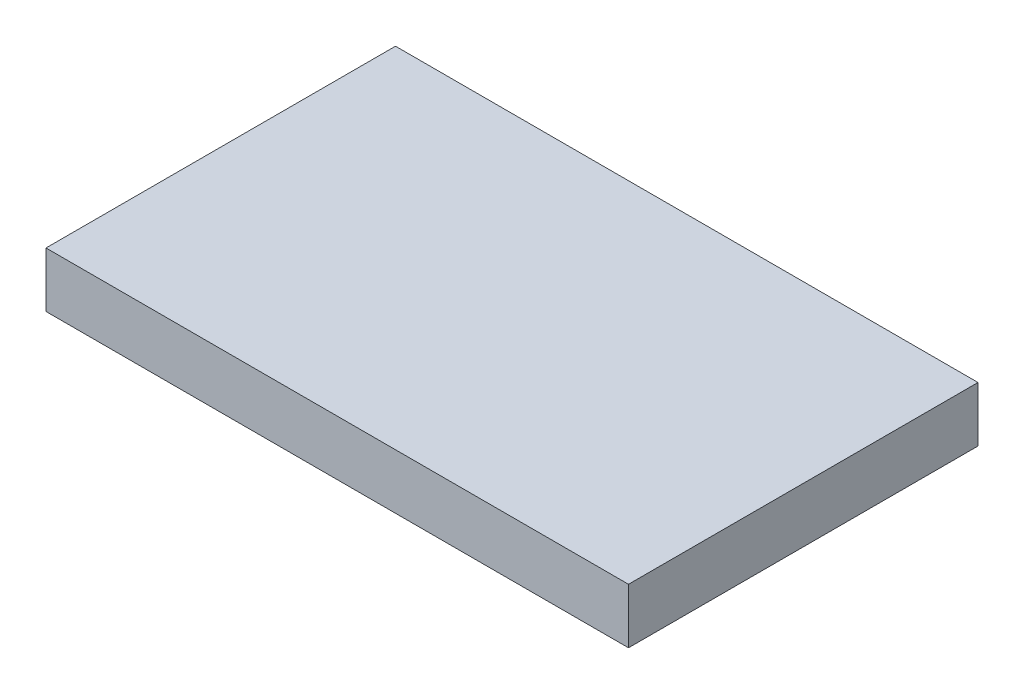
ISO-10303-21;
HEADER;
FILE_DESCRIPTION(('STEP AP214'),'2;1');
FILE_NAME('part.step','',(''),(''),'','','');
FILE_SCHEMA(('AUTOMOTIVE_DESIGN { 1 0 10303 214 1 1 1 1 }'));
ENDSEC;
DATA;
#1=APPLICATION_CONTEXT('core data for automotive mechanical design processes');
#2=APPLICATION_PROTOCOL_DEFINITION('international standard','automotive_design',2000,#1);
#3=PRODUCT_CONTEXT('',#1,'mechanical');
#4=PRODUCT('Part','Part','',(#3));
#5=PRODUCT_RELATED_PRODUCT_CATEGORY('part','',(#4));
#6=PRODUCT_DEFINITION_FORMATION('','',#4);
#7=PRODUCT_DEFINITION_CONTEXT('part definition',#1,'design');
#8=PRODUCT_DEFINITION('design','',#6,#7);
#9=PRODUCT_DEFINITION_SHAPE('','',#8);
#10=(LENGTH_UNIT() NAMED_UNIT(*) SI_UNIT(.MILLI.,.METRE.));
#11=(NAMED_UNIT(*) PLANE_ANGLE_UNIT() SI_UNIT($,.RADIAN.));
#12=(NAMED_UNIT(*) SI_UNIT($,.STERADIAN.) SOLID_ANGLE_UNIT());
#13=UNCERTAINTY_MEASURE_WITH_UNIT(LENGTH_MEASURE(1.E-05),#10,'distance_accuracy_value','');
#14=(GEOMETRIC_REPRESENTATION_CONTEXT(3) GLOBAL_UNCERTAINTY_ASSIGNED_CONTEXT((#13)) GLOBAL_UNIT_ASSIGNED_CONTEXT((#10,
#11,#12)) REPRESENTATION_CONTEXT('',''));
#15=CARTESIAN_POINT('',(0.,0.,0.));
#16=DIRECTION('',(0.,0.,1.));
#17=DIRECTION('',(1.,0.,0.));
#18=AXIS2_PLACEMENT_3D('',#15,#16,#17);
#19=CARTESIAN_POINT('',(15.875,3.,9.525));
#20=DIRECTION('',(-1.,0.,0.));
#21=DIRECTION('',(0.,0.,1.));
#22=AXIS2_PLACEMENT_3D('',#19,#20,#21);
#23=PLANE('',#22);
#24=DIRECTION('',(0.,0.,-1.));
#25=VECTOR('',#24,1.);
#26=CARTESIAN_POINT('',(15.875,0.,9.525));
#27=LINE('',#26,#25);
#28=CARTESIAN_POINT('',(15.875,0.,9.525));
#29=VERTEX_POINT('',#28);
#30=CARTESIAN_POINT('',(15.875,0.,-9.525));
#31=VERTEX_POINT('',#30);
#32=EDGE_CURVE('E98',#29,#31,#27,.T.);
#33=ORIENTED_EDGE('',*,*,#32,.T.);
#34=DIRECTION('',(0.,-1.,0.));
#35=VECTOR('',#34,1.);
#36=CARTESIAN_POINT('',(15.875,3.,-9.525));
#37=LINE('',#36,#35);
#38=CARTESIAN_POINT('',(15.875,3.,-9.525));
#39=VERTEX_POINT('',#38);
#40=EDGE_CURVE('E11',#39,#31,#37,.T.);
#41=ORIENTED_EDGE('',*,*,#40,.F.);
#42=DIRECTION('',(0.,0.,-1.));
#43=VECTOR('',#42,1.);
#44=CARTESIAN_POINT('',(15.875,3.,9.525));
#45=LINE('',#44,#43);
#46=CARTESIAN_POINT('',(15.875,3.,9.525));
#47=VERTEX_POINT('',#46);
#48=EDGE_CURVE('E86',#47,#39,#45,.T.);
#49=ORIENTED_EDGE('',*,*,#48,.F.);
#50=DIRECTION('',(0.,-1.,0.));
#51=VECTOR('',#50,1.);
#52=CARTESIAN_POINT('',(15.875,3.,9.525));
#53=LINE('',#52,#51);
#54=EDGE_CURVE('E94',#47,#29,#53,.T.);
#55=ORIENTED_EDGE('',*,*,#54,.T.);
#56=EDGE_LOOP('',(#33,#41,#49,#55));
#57=FACE_BOUND('',#56,.T.);
#58=ADVANCED_FACE('F35',(#57),#23,.F.);
#59=CARTESIAN_POINT('',(-15.875,3.,-9.525));
#60=DIRECTION('',(0.,0.,1.));
#61=DIRECTION('',(1.,0.,0.));
#62=AXIS2_PLACEMENT_3D('',#59,#60,#61);
#63=PLANE('',#62);
#64=DIRECTION('',(-1.,0.,0.));
#65=VECTOR('',#64,1.);
#66=CARTESIAN_POINT('',(-15.875,0.,-9.525));
#67=LINE('',#66,#65);
#68=CARTESIAN_POINT('',(-15.875,0.,-9.525));
#69=VERTEX_POINT('',#68);
#70=EDGE_CURVE('E90',#31,#69,#67,.T.);
#71=ORIENTED_EDGE('',*,*,#70,.T.);
#72=DIRECTION('',(0.,-1.,0.));
#73=VECTOR('',#72,1.);
#74=CARTESIAN_POINT('',(-15.875,3.,-9.525));
#75=LINE('',#74,#73);
#76=CARTESIAN_POINT('',(-15.875,3.,-9.525));
#77=VERTEX_POINT('',#76);
#78=EDGE_CURVE('E43',#77,#69,#75,.T.);
#79=ORIENTED_EDGE('',*,*,#78,.F.);
#80=DIRECTION('',(-1.,0.,0.));
#81=VECTOR('',#80,1.);
#82=CARTESIAN_POINT('',(-15.875,3.,-9.525));
#83=LINE('',#82,#81);
#84=EDGE_CURVE('E81',#39,#77,#83,.T.);
#85=ORIENTED_EDGE('',*,*,#84,.F.);
#86=ORIENTED_EDGE('',*,*,#40,.T.);
#87=EDGE_LOOP('',(#71,#79,#85,#86));
#88=FACE_BOUND('',#87,.T.);
#89=ADVANCED_FACE('F89',(#88),#63,.F.);
#90=CARTESIAN_POINT('',(-15.875,3.,9.525));
#91=DIRECTION('',(1.,0.,0.));
#92=DIRECTION('',(0.,0.,-1.));
#93=AXIS2_PLACEMENT_3D('',#90,#91,#92);
#94=PLANE('',#93);
#95=DIRECTION('',(0.,0.,1.));
#96=VECTOR('',#95,1.);
#97=CARTESIAN_POINT('',(-15.875,0.,9.525));
#98=LINE('',#97,#96);
#99=CARTESIAN_POINT('',(-15.875,0.,9.525));
#100=VERTEX_POINT('',#99);
#101=EDGE_CURVE('E68',#69,#100,#98,.T.);
#102=ORIENTED_EDGE('',*,*,#101,.T.);
#103=DIRECTION('',(0.,-1.,0.));
#104=VECTOR('',#103,1.);
#105=CARTESIAN_POINT('',(-15.875,3.,9.525));
#106=LINE('',#105,#104);
#107=CARTESIAN_POINT('',(-15.875,3.,9.525));
#108=VERTEX_POINT('',#107);
#109=EDGE_CURVE('E91',#108,#100,#106,.T.);
#110=ORIENTED_EDGE('',*,*,#109,.F.);
#111=DIRECTION('',(0.,0.,1.));
#112=VECTOR('',#111,1.);
#113=CARTESIAN_POINT('',(-15.875,3.,9.525));
#114=LINE('',#113,#112);
#115=EDGE_CURVE('E84',#77,#108,#114,.T.);
#116=ORIENTED_EDGE('',*,*,#115,.F.);
#117=ORIENTED_EDGE('',*,*,#78,.T.);
#118=EDGE_LOOP('',(#102,#110,#116,#117));
#119=FACE_BOUND('',#118,.T.);
#120=ADVANCED_FACE('F92',(#119),#94,.F.);
#121=CARTESIAN_POINT('',(-15.875,3.,9.525));
#122=DIRECTION('',(0.,0.,-1.));
#123=DIRECTION('',(-1.,0.,0.));
#124=AXIS2_PLACEMENT_3D('',#121,#122,#123);
#125=PLANE('',#124);
#126=DIRECTION('',(1.,0.,0.));
#127=VECTOR('',#126,1.);
#128=CARTESIAN_POINT('',(-15.875,0.,9.525));
#129=LINE('',#128,#127);
#130=EDGE_CURVE('E74',#100,#29,#129,.T.);
#131=ORIENTED_EDGE('',*,*,#130,.T.);
#132=ORIENTED_EDGE('',*,*,#54,.F.);
#133=DIRECTION('',(1.,0.,0.));
#134=VECTOR('',#133,1.);
#135=CARTESIAN_POINT('',(-15.875,3.,9.525));
#136=LINE('',#135,#134);
#137=EDGE_CURVE('E51',#108,#47,#136,.T.);
#138=ORIENTED_EDGE('',*,*,#137,.F.);
#139=ORIENTED_EDGE('',*,*,#109,.T.);
#140=EDGE_LOOP('',(#131,#132,#138,#139));
#141=FACE_BOUND('',#140,.T.);
#142=ADVANCED_FACE('F105',(#141),#125,.F.);
#143=CARTESIAN_POINT('',(0.,3.,0.));
#144=DIRECTION('',(0.,-1.,0.));
#145=DIRECTION('',(0.,0.,-1.));
#146=AXIS2_PLACEMENT_3D('',#143,#144,#145);
#147=PLANE('',#146);
#148=ORIENTED_EDGE('',*,*,#48,.T.);
#149=ORIENTED_EDGE('',*,*,#84,.T.);
#150=ORIENTED_EDGE('',*,*,#115,.T.);
#151=ORIENTED_EDGE('',*,*,#137,.T.);
#152=EDGE_LOOP('',(#148,#149,#150,#151));
#153=FACE_BOUND('',#152,.T.);
#154=ADVANCED_FACE('F82',(#153),#147,.F.);
#155=CARTESIAN_POINT('',(0.,0.,0.));
#156=DIRECTION('',(0.,-1.,0.));
#157=DIRECTION('',(0.,0.,-1.));
#158=AXIS2_PLACEMENT_3D('',#155,#156,#157);
#159=PLANE('',#158);
#160=ORIENTED_EDGE('',*,*,#32,.F.);
#161=ORIENTED_EDGE('',*,*,#130,.F.);
#162=ORIENTED_EDGE('',*,*,#101,.F.);
#163=ORIENTED_EDGE('',*,*,#70,.F.);
#164=EDGE_LOOP('',(#160,#161,#162,#163));
#165=FACE_BOUND('',#164,.T.);
#166=ADVANCED_FACE('F108',(#165),#159,.T.);
#167=CLOSED_SHELL('',(#58,#89,#120,#142,#154,#166));
#168=MANIFOLD_SOLID_BREP('B2',#167);
#169=ADVANCED_BREP_SHAPE_REPRESENTATION('',(#18,#168),#14);
#170=SHAPE_DEFINITION_REPRESENTATION(#9,#169);
ENDSEC;
END-ISO-10303-21;
